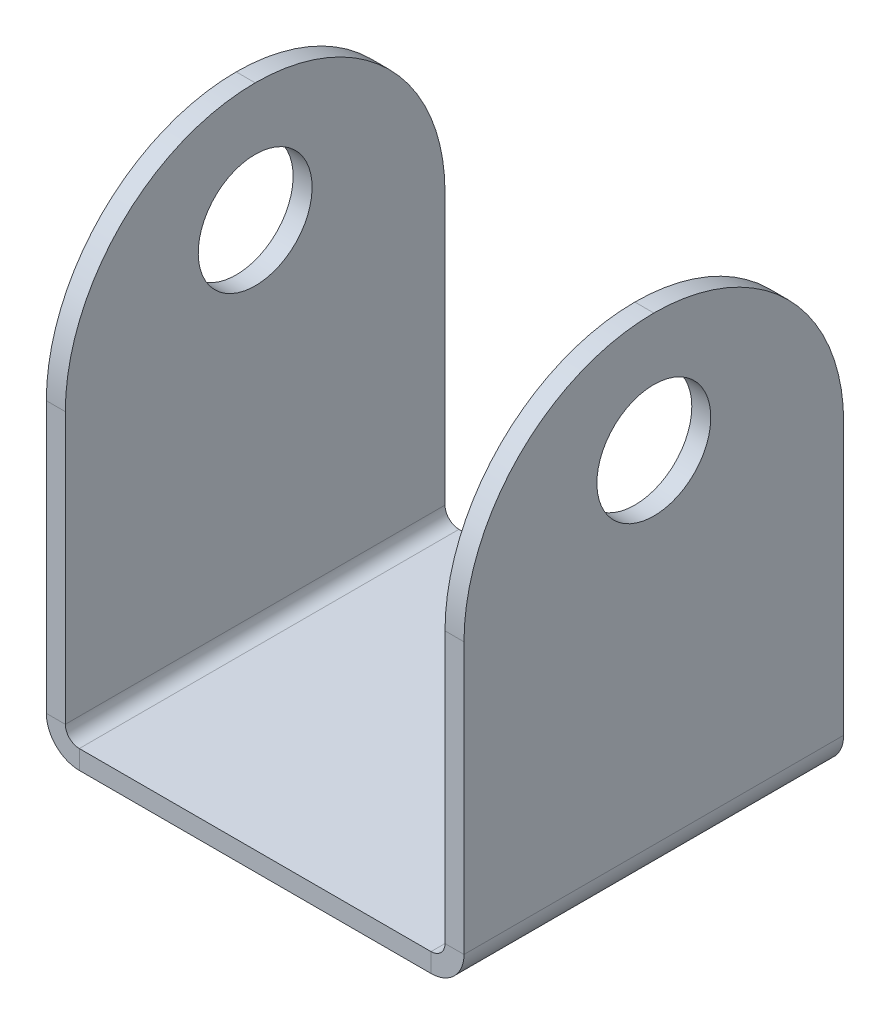
ISO-10303-21;
HEADER;
FILE_DESCRIPTION(('STEP AP214'),'2;1');
FILE_NAME('part.step','',(''),(''),'','','');
FILE_SCHEMA(('AUTOMOTIVE_DESIGN { 1 0 10303 214 1 1 1 1 }'));
ENDSEC;
DATA;
#1=APPLICATION_CONTEXT('core data for automotive mechanical design processes');
#2=APPLICATION_PROTOCOL_DEFINITION('international standard','automotive_design',2000,#1);
#3=PRODUCT_CONTEXT('',#1,'mechanical');
#4=PRODUCT('Part','Part','',(#3));
#5=PRODUCT_RELATED_PRODUCT_CATEGORY('part','',(#4));
#6=PRODUCT_DEFINITION_FORMATION('','',#4);
#7=PRODUCT_DEFINITION_CONTEXT('part definition',#1,'design');
#8=PRODUCT_DEFINITION('design','',#6,#7);
#9=PRODUCT_DEFINITION_SHAPE('','',#8);
#10=(LENGTH_UNIT() NAMED_UNIT(*) SI_UNIT(.MILLI.,.METRE.));
#11=(NAMED_UNIT(*) PLANE_ANGLE_UNIT() SI_UNIT($,.RADIAN.));
#12=(NAMED_UNIT(*) SI_UNIT($,.STERADIAN.) SOLID_ANGLE_UNIT());
#13=UNCERTAINTY_MEASURE_WITH_UNIT(LENGTH_MEASURE(1.E-05),#10,'distance_accuracy_value','');
#14=(GEOMETRIC_REPRESENTATION_CONTEXT(3) GLOBAL_UNCERTAINTY_ASSIGNED_CONTEXT((#13)) GLOBAL_UNIT_ASSIGNED_CONTEXT((#10,
#11,#12)) REPRESENTATION_CONTEXT('',''));
#15=CARTESIAN_POINT('',(0.,0.,0.));
#16=DIRECTION('',(0.,0.,1.));
#17=DIRECTION('',(1.,0.,0.));
#18=AXIS2_PLACEMENT_3D('',#15,#16,#17);
#19=CARTESIAN_POINT('',(0.,-1.,0.));
#20=DIRECTION('',(0.,-1.,0.));
#21=DIRECTION('',(0.,0.,-1.));
#22=AXIS2_PLACEMENT_3D('',#19,#20,#21);
#23=PLANE('',#22);
#24=DIRECTION('',(1.,0.,0.));
#25=VECTOR('',#24,1.);
#26=CARTESIAN_POINT('',(-10.,-1.,10.));
#27=LINE('',#26,#25);
#28=CARTESIAN_POINT('',(-9.2634,-1.,10.));
#29=VERTEX_POINT('',#28);
#30=CARTESIAN_POINT('',(9.2634,-1.,10.));
#31=VERTEX_POINT('',#30);
#32=EDGE_CURVE('E241',#29,#31,#27,.T.);
#33=ORIENTED_EDGE('',*,*,#32,.F.);
#34=DIRECTION('',(0.,0.,1.));
#35=VECTOR('',#34,1.);
#36=CARTESIAN_POINT('',(-9.2634,-1.,10.));
#37=LINE('',#36,#35);
#38=CARTESIAN_POINT('',(-9.2634,-1.,-10.));
#39=VERTEX_POINT('',#38);
#40=EDGE_CURVE('E147',#29,#39,#37,.F.);
#41=ORIENTED_EDGE('',*,*,#40,.T.);
#42=DIRECTION('',(-1.,0.,0.));
#43=VECTOR('',#42,1.);
#44=CARTESIAN_POINT('',(-10.,-1.,-10.));
#45=LINE('',#44,#43);
#46=CARTESIAN_POINT('',(9.2634,-1.,-10.));
#47=VERTEX_POINT('',#46);
#48=EDGE_CURVE('E238',#47,#39,#45,.T.);
#49=ORIENTED_EDGE('',*,*,#48,.F.);
#50=DIRECTION('',(0.,0.,-1.));
#51=VECTOR('',#50,1.);
#52=CARTESIAN_POINT('',(9.2634,-1.,-10.));
#53=LINE('',#52,#51);
#54=EDGE_CURVE('E215',#47,#31,#53,.F.);
#55=ORIENTED_EDGE('',*,*,#54,.T.);
#56=EDGE_LOOP('',(#33,#41,#49,#55));
#57=FACE_BOUND('',#56,.T.);
#58=ADVANCED_FACE('F40',(#57),#23,.T.);
#59=CARTESIAN_POINT('',(0.,0.,0.));
#60=DIRECTION('',(0.,-1.,0.));
#61=DIRECTION('',(0.,0.,-1.));
#62=AXIS2_PLACEMENT_3D('',#59,#60,#61);
#63=PLANE('',#62);
#64=DIRECTION('',(0.,0.,1.));
#65=VECTOR('',#64,1.);
#66=CARTESIAN_POINT('',(-9.2634,0.,10.));
#67=LINE('',#66,#65);
#68=CARTESIAN_POINT('',(-9.2634,0.,10.));
#69=VERTEX_POINT('',#68);
#70=CARTESIAN_POINT('',(-9.2634,0.,-10.));
#71=VERTEX_POINT('',#70);
#72=EDGE_CURVE('E176',#69,#71,#67,.F.);
#73=ORIENTED_EDGE('',*,*,#72,.F.);
#74=DIRECTION('',(1.,0.,0.));
#75=VECTOR('',#74,1.);
#76=CARTESIAN_POINT('',(-10.,0.,10.));
#77=LINE('',#76,#75);
#78=CARTESIAN_POINT('',(9.2634,0.,10.));
#79=VERTEX_POINT('',#78);
#80=EDGE_CURVE('E242',#69,#79,#77,.T.);
#81=ORIENTED_EDGE('',*,*,#80,.T.);
#82=DIRECTION('',(0.,0.,-1.));
#83=VECTOR('',#82,1.);
#84=CARTESIAN_POINT('',(9.2634,0.,-10.));
#85=LINE('',#84,#83);
#86=CARTESIAN_POINT('',(9.2634,0.,-10.));
#87=VERTEX_POINT('',#86);
#88=EDGE_CURVE('E228',#87,#79,#85,.F.);
#89=ORIENTED_EDGE('',*,*,#88,.F.);
#90=DIRECTION('',(-1.,0.,0.));
#91=VECTOR('',#90,1.);
#92=CARTESIAN_POINT('',(-10.,0.,-10.));
#93=LINE('',#92,#91);
#94=EDGE_CURVE('E235',#87,#71,#93,.T.);
#95=ORIENTED_EDGE('',*,*,#94,.T.);
#96=EDGE_LOOP('',(#73,#81,#89,#95));
#97=FACE_BOUND('',#96,.T.);
#98=ADVANCED_FACE('F329',(#97),#63,.F.);
#99=CARTESIAN_POINT('',(-10.,-1.,10.));
#100=DIRECTION('',(0.,0.,1.));
#101=DIRECTION('',(1.,0.,0.));
#102=AXIS2_PLACEMENT_3D('',#99,#100,#101);
#103=PLANE('',#102);
#104=ORIENTED_EDGE('',*,*,#80,.F.);
#105=DIRECTION('',(0.,-1.,0.));
#106=VECTOR('',#105,1.);
#107=CARTESIAN_POINT('',(-9.2634,0.,10.));
#108=LINE('',#107,#106);
#109=EDGE_CURVE('E185',#69,#29,#108,.T.);
#110=ORIENTED_EDGE('',*,*,#109,.T.);
#111=ORIENTED_EDGE('',*,*,#32,.T.);
#112=DIRECTION('',(0.,-1.,0.));
#113=VECTOR('',#112,1.);
#114=CARTESIAN_POINT('',(9.2634,0.,10.));
#115=LINE('',#114,#113);
#116=EDGE_CURVE('E232',#79,#31,#115,.T.);
#117=ORIENTED_EDGE('',*,*,#116,.F.);
#118=EDGE_LOOP('',(#104,#110,#111,#117));
#119=FACE_BOUND('',#118,.T.);
#120=ADVANCED_FACE('F320',(#119),#103,.T.);
#121=CARTESIAN_POINT('',(-10.,-1.,-10.));
#122=DIRECTION('',(0.,0.,-1.));
#123=DIRECTION('',(-1.,0.,0.));
#124=AXIS2_PLACEMENT_3D('',#121,#122,#123);
#125=PLANE('',#124);
#126=DIRECTION('',(0.,-1.,0.));
#127=VECTOR('',#126,1.);
#128=CARTESIAN_POINT('',(-9.2634,0.,-10.));
#129=LINE('',#128,#127);
#130=EDGE_CURVE('E190',#71,#39,#129,.T.);
#131=ORIENTED_EDGE('',*,*,#130,.F.);
#132=ORIENTED_EDGE('',*,*,#94,.F.);
#133=DIRECTION('',(0.,-1.,0.));
#134=VECTOR('',#133,1.);
#135=CARTESIAN_POINT('',(9.2634,0.,-10.));
#136=LINE('',#135,#134);
#137=EDGE_CURVE('E222',#87,#47,#136,.T.);
#138=ORIENTED_EDGE('',*,*,#137,.T.);
#139=ORIENTED_EDGE('',*,*,#48,.T.);
#140=EDGE_LOOP('',(#131,#132,#138,#139));
#141=FACE_BOUND('',#140,.T.);
#142=ADVANCED_FACE('F326',(#141),#125,.T.);
#143=CARTESIAN_POINT('',(9.2634,0.7366,10.));
#144=DIRECTION('',(0.,0.,1.));
#145=DIRECTION('',(1.,0.,0.));
#146=AXIS2_PLACEMENT_3D('',#143,#144,#145);
#147=PLANE('',#146);
#148=DIRECTION('',(1.,0.,0.));
#149=VECTOR('',#148,1.);
#150=CARTESIAN_POINT('',(10.,0.736599999999997,10.));
#151=LINE('',#150,#149);
#152=CARTESIAN_POINT('',(10.,0.736599999999997,10.));
#153=VERTEX_POINT('',#152);
#154=CARTESIAN_POINT('',(11.,0.736599999999993,10.));
#155=VERTEX_POINT('',#154);
#156=EDGE_CURVE('E193',#153,#155,#151,.T.);
#157=ORIENTED_EDGE('',*,*,#156,.F.);
#158=CARTESIAN_POINT('',(9.2634,0.7366,10.));
#159=DIRECTION('',(0.,0.,-1.));
#160=DIRECTION('',(-1.,0.,0.));
#161=AXIS2_PLACEMENT_3D('',#158,#159,#160);
#162=CIRCLE('',#161,0.7366);
#163=EDGE_CURVE('E225',#79,#153,#162,.F.);
#164=ORIENTED_EDGE('',*,*,#163,.F.);
#165=ORIENTED_EDGE('',*,*,#116,.T.);
#166=CARTESIAN_POINT('',(9.2634,0.7366,10.));
#167=DIRECTION('',(0.,0.,-1.));
#168=DIRECTION('',(-1.,0.,0.));
#169=AXIS2_PLACEMENT_3D('',#166,#167,#168);
#170=CIRCLE('',#169,1.7366);
#171=EDGE_CURVE('E218',#31,#155,#170,.F.);
#172=ORIENTED_EDGE('',*,*,#171,.T.);
#173=EDGE_LOOP('',(#157,#164,#165,#172));
#174=FACE_BOUND('',#173,.T.);
#175=ADVANCED_FACE('F315',(#174),#147,.T.);
#176=CARTESIAN_POINT('',(9.2634,0.7366,-10.));
#177=DIRECTION('',(0.,0.,1.));
#178=DIRECTION('',(1.,0.,0.));
#179=AXIS2_PLACEMENT_3D('',#176,#177,#178);
#180=PLANE('',#179);
#181=CARTESIAN_POINT('',(9.2634,0.7366,-10.));
#182=DIRECTION('',(0.,0.,-1.));
#183=DIRECTION('',(-1.,0.,0.));
#184=AXIS2_PLACEMENT_3D('',#181,#182,#183);
#185=CIRCLE('',#184,0.7366);
#186=CARTESIAN_POINT('',(10.,0.736599999999997,-10.));
#187=VERTEX_POINT('',#186);
#188=EDGE_CURVE('E211',#187,#87,#185,.T.);
#189=ORIENTED_EDGE('',*,*,#188,.F.);
#190=DIRECTION('',(1.,0.,0.));
#191=VECTOR('',#190,1.);
#192=CARTESIAN_POINT('',(10.,0.736599999999997,-10.));
#193=LINE('',#192,#191);
#194=CARTESIAN_POINT('',(11.,0.736599999999993,-10.));
#195=VERTEX_POINT('',#194);
#196=EDGE_CURVE('E197',#187,#195,#193,.T.);
#197=ORIENTED_EDGE('',*,*,#196,.T.);
#198=CARTESIAN_POINT('',(9.2634,0.7366,-10.));
#199=DIRECTION('',(0.,0.,-1.));
#200=DIRECTION('',(-1.,0.,0.));
#201=AXIS2_PLACEMENT_3D('',#198,#199,#200);
#202=CIRCLE('',#201,1.7366);
#203=EDGE_CURVE('E219',#195,#47,#202,.T.);
#204=ORIENTED_EDGE('',*,*,#203,.T.);
#205=ORIENTED_EDGE('',*,*,#137,.F.);
#206=EDGE_LOOP('',(#189,#197,#204,#205));
#207=FACE_BOUND('',#206,.T.);
#208=ADVANCED_FACE('F306',(#207),#180,.F.);
#209=CARTESIAN_POINT('',(9.2634,0.7366,-10.));
#210=DIRECTION('',(0.,0.,-1.));
#211=DIRECTION('',(1.,0.,0.));
#212=AXIS2_PLACEMENT_3D('',#209,#210,#211);
#213=CYLINDRICAL_SURFACE('',#212,1.7366);
#214=ORIENTED_EDGE('',*,*,#54,.F.);
#215=ORIENTED_EDGE('',*,*,#203,.F.);
#216=DIRECTION('',(0.,0.,1.));
#217=VECTOR('',#216,1.);
#218=CARTESIAN_POINT('',(11.,0.736599999999993,0.));
#219=LINE('',#218,#217);
#220=EDGE_CURVE('E200',#195,#155,#219,.T.);
#221=ORIENTED_EDGE('',*,*,#220,.T.);
#222=ORIENTED_EDGE('',*,*,#171,.F.);
#223=EDGE_LOOP('',(#214,#215,#221,#222));
#224=FACE_BOUND('',#223,.T.);
#225=ADVANCED_FACE('F313',(#224),#213,.T.);
#226=CARTESIAN_POINT('',(9.2634,0.7366,-10.));
#227=DIRECTION('',(0.,0.,-1.));
#228=DIRECTION('',(1.,0.,0.));
#229=AXIS2_PLACEMENT_3D('',#226,#227,#228);
#230=CYLINDRICAL_SURFACE('',#229,0.7366);
#231=ORIENTED_EDGE('',*,*,#88,.T.);
#232=ORIENTED_EDGE('',*,*,#163,.T.);
#233=DIRECTION('',(0.,0.,-1.));
#234=VECTOR('',#233,1.);
#235=CARTESIAN_POINT('',(10.,0.736599999999997,10.));
#236=LINE('',#235,#234);
#237=EDGE_CURVE('E195',#153,#187,#236,.T.);
#238=ORIENTED_EDGE('',*,*,#237,.T.);
#239=ORIENTED_EDGE('',*,*,#188,.T.);
#240=EDGE_LOOP('',(#231,#232,#238,#239));
#241=FACE_BOUND('',#240,.T.);
#242=ADVANCED_FACE('F301',(#241),#230,.F.);
#243=CARTESIAN_POINT('',(11.,0.,10.));
#244=DIRECTION('',(0.,0.,-1.));
#245=DIRECTION('',(-1.,0.,0.));
#246=AXIS2_PLACEMENT_3D('',#243,#244,#245);
#247=PLANE('',#246);
#248=DIRECTION('',(0.,-1.,0.));
#249=VECTOR('',#248,1.);
#250=CARTESIAN_POINT('',(11.,0.,10.));
#251=LINE('',#250,#249);
#252=CARTESIAN_POINT('',(11.0000000000001,15.,10.));
#253=VERTEX_POINT('',#252);
#254=EDGE_CURVE('E206',#253,#155,#251,.T.);
#255=ORIENTED_EDGE('',*,*,#254,.F.);
#256=DIRECTION('',(-1.,0.,0.));
#257=VECTOR('',#256,1.);
#258=CARTESIAN_POINT('',(11.0000000000001,15.,10.));
#259=LINE('',#258,#257);
#260=CARTESIAN_POINT('',(10.0000000000001,15.,10.));
#261=VERTEX_POINT('',#260);
#262=EDGE_CURVE('E49',#253,#261,#259,.T.);
#263=ORIENTED_EDGE('',*,*,#262,.T.);
#264=DIRECTION('',(0.,-1.,0.));
#265=VECTOR('',#264,1.);
#266=CARTESIAN_POINT('',(10.,0.,10.));
#267=LINE('',#266,#265);
#268=EDGE_CURVE('E205',#261,#153,#267,.T.);
#269=ORIENTED_EDGE('',*,*,#268,.T.);
#270=ORIENTED_EDGE('',*,*,#156,.T.);
#271=EDGE_LOOP('',(#255,#263,#269,#270));
#272=FACE_BOUND('',#271,.T.);
#273=ADVANCED_FACE('F293',(#272),#247,.F.);
#274=CARTESIAN_POINT('',(11.0000000000001,25.,-10.));
#275=DIRECTION('',(0.,0.,1.));
#276=DIRECTION('',(0.,-1.,0.));
#277=AXIS2_PLACEMENT_3D('',#274,#275,#276);
#278=PLANE('',#277);
#279=DIRECTION('',(0.,1.,0.));
#280=VECTOR('',#279,1.);
#281=CARTESIAN_POINT('',(10.0000000000001,25.,-10.));
#282=LINE('',#281,#280);
#283=CARTESIAN_POINT('',(10.0000000000001,15.,-10.));
#284=VERTEX_POINT('',#283);
#285=EDGE_CURVE('E209',#187,#284,#282,.T.);
#286=ORIENTED_EDGE('',*,*,#285,.T.);
#287=DIRECTION('',(-1.,0.,0.));
#288=VECTOR('',#287,1.);
#289=CARTESIAN_POINT('',(11.0000000000001,15.,-10.));
#290=LINE('',#289,#288);
#291=CARTESIAN_POINT('',(11.0000000000001,15.,-10.));
#292=VERTEX_POINT('',#291);
#293=EDGE_CURVE('E269',#284,#292,#290,.F.);
#294=ORIENTED_EDGE('',*,*,#293,.T.);
#295=DIRECTION('',(0.,1.,0.));
#296=VECTOR('',#295,1.);
#297=CARTESIAN_POINT('',(11.0000000000001,25.,-10.));
#298=LINE('',#297,#296);
#299=EDGE_CURVE('E208',#195,#292,#298,.T.);
#300=ORIENTED_EDGE('',*,*,#299,.F.);
#301=ORIENTED_EDGE('',*,*,#196,.F.);
#302=EDGE_LOOP('',(#286,#294,#300,#301));
#303=FACE_BOUND('',#302,.T.);
#304=ADVANCED_FACE('F310',(#303),#278,.F.);
#305=CARTESIAN_POINT('',(11.,0.,0.));
#306=DIRECTION('',(-1.,0.,0.));
#307=DIRECTION('',(0.,-1.,0.));
#308=AXIS2_PLACEMENT_3D('',#305,#306,#307);
#309=PLANE('',#308);
#310=CARTESIAN_POINT('',(11.0000000000001,18.7366,0.));
#311=DIRECTION('',(1.,0.,0.));
#312=DIRECTION('',(0.,1.,0.));
#313=AXIS2_PLACEMENT_3D('',#310,#311,#312);
#314=CIRCLE('',#313,3.);
#315=CARTESIAN_POINT('',(11.0000000000001,21.7366,0.));
#316=VERTEX_POINT('',#315);
#317=EDGE_CURVE('E276',#316,#316,#314,.T.);
#318=ORIENTED_EDGE('',*,*,#317,.F.);
#319=EDGE_LOOP('',(#318));
#320=FACE_BOUND('',#319,.T.);
#321=ORIENTED_EDGE('',*,*,#299,.T.);
#322=CARTESIAN_POINT('',(11.0000000000001,15.,0.));
#323=DIRECTION('',(-1.,0.,0.));
#324=DIRECTION('',(0.,-1.,0.));
#325=AXIS2_PLACEMENT_3D('',#322,#323,#324);
#326=CIRCLE('',#325,10.);
#327=CARTESIAN_POINT('',(11.0000000000001,25.,0.));
#328=VERTEX_POINT('',#327);
#329=EDGE_CURVE('E62',#292,#328,#326,.F.);
#330=ORIENTED_EDGE('',*,*,#329,.T.);
#331=CARTESIAN_POINT('',(11.0000000000001,15.,0.));
#332=DIRECTION('',(-1.,0.,0.));
#333=DIRECTION('',(0.,-1.,0.));
#334=AXIS2_PLACEMENT_3D('',#331,#332,#333);
#335=CIRCLE('',#334,10.);
#336=EDGE_CURVE('E57',#328,#253,#335,.F.);
#337=ORIENTED_EDGE('',*,*,#336,.T.);
#338=ORIENTED_EDGE('',*,*,#254,.T.);
#339=ORIENTED_EDGE('',*,*,#220,.F.);
#340=EDGE_LOOP('',(#321,#330,#337,#338,#339));
#341=FACE_BOUND('',#340,.T.);
#342=ADVANCED_FACE('F311',(#320,#341),#309,.F.);
#343=CARTESIAN_POINT('',(10.,0.,0.));
#344=DIRECTION('',(-1.,0.,0.));
#345=DIRECTION('',(0.,-1.,0.));
#346=AXIS2_PLACEMENT_3D('',#343,#344,#345);
#347=PLANE('',#346);
#348=CARTESIAN_POINT('',(10.0000000000001,18.7366,0.));
#349=DIRECTION('',(-1.,0.,0.));
#350=DIRECTION('',(0.,-1.,0.));
#351=AXIS2_PLACEMENT_3D('',#348,#349,#350);
#352=CIRCLE('',#351,3.);
#353=CARTESIAN_POINT('',(10.0000000000001,15.7366,0.));
#354=VERTEX_POINT('',#353);
#355=EDGE_CURVE('E253',#354,#354,#352,.T.);
#356=ORIENTED_EDGE('',*,*,#355,.F.);
#357=EDGE_LOOP('',(#356));
#358=FACE_BOUND('',#357,.T.);
#359=CARTESIAN_POINT('',(10.0000000000001,15.,0.));
#360=DIRECTION('',(-1.,0.,0.));
#361=DIRECTION('',(0.,-1.,0.));
#362=AXIS2_PLACEMENT_3D('',#359,#360,#361);
#363=CIRCLE('',#362,10.);
#364=CARTESIAN_POINT('',(10.0000000000001,25.,0.));
#365=VERTEX_POINT('',#364);
#366=EDGE_CURVE('E265',#261,#365,#363,.T.);
#367=ORIENTED_EDGE('',*,*,#366,.T.);
#368=CARTESIAN_POINT('',(10.0000000000001,15.,0.));
#369=DIRECTION('',(-1.,0.,0.));
#370=DIRECTION('',(0.,-1.,0.));
#371=AXIS2_PLACEMENT_3D('',#368,#369,#370);
#372=CIRCLE('',#371,10.);
#373=EDGE_CURVE('E267',#365,#284,#372,.T.);
#374=ORIENTED_EDGE('',*,*,#373,.T.);
#375=ORIENTED_EDGE('',*,*,#285,.F.);
#376=ORIENTED_EDGE('',*,*,#237,.F.);
#377=ORIENTED_EDGE('',*,*,#268,.F.);
#378=EDGE_LOOP('',(#367,#374,#375,#376,#377));
#379=FACE_BOUND('',#378,.T.);
#380=ADVANCED_FACE('F297',(#358,#379),#347,.T.);
#381=CARTESIAN_POINT('',(-9.2634,0.7366,-10.));
#382=DIRECTION('',(0.,0.,-1.));
#383=DIRECTION('',(-1.,0.,0.));
#384=AXIS2_PLACEMENT_3D('',#381,#382,#383);
#385=PLANE('',#384);
#386=DIRECTION('',(-1.,0.,0.));
#387=VECTOR('',#386,1.);
#388=CARTESIAN_POINT('',(-10.,0.736599999999997,-10.));
#389=LINE('',#388,#387);
#390=CARTESIAN_POINT('',(-10.,0.736599999999997,-10.));
#391=VERTEX_POINT('',#390);
#392=CARTESIAN_POINT('',(-11.,0.736599999999993,-10.));
#393=VERTEX_POINT('',#392);
#394=EDGE_CURVE('E338',#391,#393,#389,.T.);
#395=ORIENTED_EDGE('',*,*,#394,.F.);
#396=CARTESIAN_POINT('',(-9.2634,0.7366,-10.));
#397=DIRECTION('',(0.,0.,1.));
#398=DIRECTION('',(1.,0.,0.));
#399=AXIS2_PLACEMENT_3D('',#396,#397,#398);
#400=CIRCLE('',#399,0.7366);
#401=EDGE_CURVE('E150',#71,#391,#400,.F.);
#402=ORIENTED_EDGE('',*,*,#401,.F.);
#403=ORIENTED_EDGE('',*,*,#130,.T.);
#404=CARTESIAN_POINT('',(-9.2634,0.7366,-10.));
#405=DIRECTION('',(0.,0.,1.));
#406=DIRECTION('',(1.,0.,0.));
#407=AXIS2_PLACEMENT_3D('',#404,#405,#406);
#408=CIRCLE('',#407,1.7366);
#409=EDGE_CURVE('E184',#39,#393,#408,.F.);
#410=ORIENTED_EDGE('',*,*,#409,.T.);
#411=EDGE_LOOP('',(#395,#402,#403,#410));
#412=FACE_BOUND('',#411,.T.);
#413=ADVANCED_FACE('F336',(#412),#385,.T.);
#414=CARTESIAN_POINT('',(-9.2634,0.7366,10.));
#415=DIRECTION('',(0.,0.,-1.));
#416=DIRECTION('',(-1.,0.,0.));
#417=AXIS2_PLACEMENT_3D('',#414,#415,#416);
#418=PLANE('',#417);
#419=CARTESIAN_POINT('',(-9.2634,0.7366,10.));
#420=DIRECTION('',(0.,0.,1.));
#421=DIRECTION('',(1.,0.,0.));
#422=AXIS2_PLACEMENT_3D('',#419,#420,#421);
#423=CIRCLE('',#422,0.7366);
#424=CARTESIAN_POINT('',(-10.,0.736599999999997,10.));
#425=VERTEX_POINT('',#424);
#426=EDGE_CURVE('E157',#425,#69,#423,.T.);
#427=ORIENTED_EDGE('',*,*,#426,.F.);
#428=DIRECTION('',(-1.,0.,0.));
#429=VECTOR('',#428,1.);
#430=CARTESIAN_POINT('',(-10.,0.736599999999997,10.));
#431=LINE('',#430,#429);
#432=CARTESIAN_POINT('',(-11.,0.736599999999993,10.));
#433=VERTEX_POINT('',#432);
#434=EDGE_CURVE('E154',#425,#433,#431,.T.);
#435=ORIENTED_EDGE('',*,*,#434,.T.);
#436=CARTESIAN_POINT('',(-9.2634,0.7366,10.));
#437=DIRECTION('',(0.,0.,1.));
#438=DIRECTION('',(1.,0.,0.));
#439=AXIS2_PLACEMENT_3D('',#436,#437,#438);
#440=CIRCLE('',#439,1.7366);
#441=EDGE_CURVE('E140',#433,#29,#440,.T.);
#442=ORIENTED_EDGE('',*,*,#441,.T.);
#443=ORIENTED_EDGE('',*,*,#109,.F.);
#444=EDGE_LOOP('',(#427,#435,#442,#443));
#445=FACE_BOUND('',#444,.T.);
#446=ADVANCED_FACE('F155',(#445),#418,.F.);
#447=CARTESIAN_POINT('',(-9.2634,0.7366,10.));
#448=DIRECTION('',(0.,0.,1.));
#449=DIRECTION('',(-1.,0.,0.));
#450=AXIS2_PLACEMENT_3D('',#447,#448,#449);
#451=CYLINDRICAL_SURFACE('',#450,1.7366);
#452=ORIENTED_EDGE('',*,*,#40,.F.);
#453=ORIENTED_EDGE('',*,*,#441,.F.);
#454=DIRECTION('',(0.,0.,-1.));
#455=VECTOR('',#454,1.);
#456=CARTESIAN_POINT('',(-11.,0.736599999999993,0.));
#457=LINE('',#456,#455);
#458=EDGE_CURVE('E144',#433,#393,#457,.T.);
#459=ORIENTED_EDGE('',*,*,#458,.T.);
#460=ORIENTED_EDGE('',*,*,#409,.F.);
#461=EDGE_LOOP('',(#452,#453,#459,#460));
#462=FACE_BOUND('',#461,.T.);
#463=ADVANCED_FACE('F142',(#462),#451,.T.);
#464=CARTESIAN_POINT('',(-9.2634,0.7366,10.));
#465=DIRECTION('',(0.,0.,1.));
#466=DIRECTION('',(-1.,0.,0.));
#467=AXIS2_PLACEMENT_3D('',#464,#465,#466);
#468=CYLINDRICAL_SURFACE('',#467,0.7366);
#469=ORIENTED_EDGE('',*,*,#72,.T.);
#470=ORIENTED_EDGE('',*,*,#401,.T.);
#471=DIRECTION('',(0.,0.,1.));
#472=VECTOR('',#471,1.);
#473=CARTESIAN_POINT('',(-10.,0.736599999999997,-10.));
#474=LINE('',#473,#472);
#475=EDGE_CURVE('E162',#391,#425,#474,.T.);
#476=ORIENTED_EDGE('',*,*,#475,.T.);
#477=ORIENTED_EDGE('',*,*,#426,.T.);
#478=EDGE_LOOP('',(#469,#470,#476,#477));
#479=FACE_BOUND('',#478,.T.);
#480=ADVANCED_FACE('F332',(#479),#468,.F.);
#481=CARTESIAN_POINT('',(-11.,0.,-10.));
#482=DIRECTION('',(0.,0.,1.));
#483=DIRECTION('',(1.,0.,0.));
#484=AXIS2_PLACEMENT_3D('',#481,#482,#483);
#485=PLANE('',#484);
#486=DIRECTION('',(0.,-1.,0.));
#487=VECTOR('',#486,1.);
#488=CARTESIAN_POINT('',(-11.,0.,-10.));
#489=LINE('',#488,#487);
#490=CARTESIAN_POINT('',(-11.0000000000001,15.,-10.));
#491=VERTEX_POINT('',#490);
#492=EDGE_CURVE('E170',#491,#393,#489,.T.);
#493=ORIENTED_EDGE('',*,*,#492,.F.);
#494=DIRECTION('',(1.,0.,0.));
#495=VECTOR('',#494,1.);
#496=CARTESIAN_POINT('',(-11.0000000000001,15.,-10.));
#497=LINE('',#496,#495);
#498=CARTESIAN_POINT('',(-10.,15.,-10.));
#499=VERTEX_POINT('',#498);
#500=EDGE_CURVE('E245',#491,#499,#497,.T.);
#501=ORIENTED_EDGE('',*,*,#500,.T.);
#502=DIRECTION('',(0.,-1.,0.));
#503=VECTOR('',#502,1.);
#504=CARTESIAN_POINT('',(-10.,0.,-10.));
#505=LINE('',#504,#503);
#506=EDGE_CURVE('E171',#499,#391,#505,.T.);
#507=ORIENTED_EDGE('',*,*,#506,.T.);
#508=ORIENTED_EDGE('',*,*,#394,.T.);
#509=EDGE_LOOP('',(#493,#501,#507,#508));
#510=FACE_BOUND('',#509,.T.);
#511=ADVANCED_FACE('F452',(#510),#485,.F.);
#512=CARTESIAN_POINT('',(-11.0000000000001,25.,9.99999999999999));
#513=DIRECTION('',(0.,0.,-1.));
#514=DIRECTION('',(0.,1.,0.));
#515=AXIS2_PLACEMENT_3D('',#512,#513,#514);
#516=PLANE('',#515);
#517=DIRECTION('',(0.,1.,0.));
#518=VECTOR('',#517,1.);
#519=CARTESIAN_POINT('',(-10.0000000000001,25.,9.99999999999999));
#520=LINE('',#519,#518);
#521=CARTESIAN_POINT('',(-10.,15.,10.));
#522=VERTEX_POINT('',#521);
#523=EDGE_CURVE('E178',#425,#522,#520,.T.);
#524=ORIENTED_EDGE('',*,*,#523,.T.);
#525=DIRECTION('',(1.,0.,0.));
#526=VECTOR('',#525,1.);
#527=CARTESIAN_POINT('',(-11.0000000000001,15.,10.));
#528=LINE('',#527,#526);
#529=CARTESIAN_POINT('',(-11.0000000000001,15.,10.));
#530=VERTEX_POINT('',#529);
#531=EDGE_CURVE('E11',#522,#530,#528,.F.);
#532=ORIENTED_EDGE('',*,*,#531,.T.);
#533=DIRECTION('',(0.,1.,0.));
#534=VECTOR('',#533,1.);
#535=CARTESIAN_POINT('',(-11.0000000000001,25.,9.99999999999999));
#536=LINE('',#535,#534);
#537=EDGE_CURVE('E167',#433,#530,#536,.T.);
#538=ORIENTED_EDGE('',*,*,#537,.F.);
#539=ORIENTED_EDGE('',*,*,#434,.F.);
#540=EDGE_LOOP('',(#524,#532,#538,#539));
#541=FACE_BOUND('',#540,.T.);
#542=ADVANCED_FACE('F173',(#541),#516,.F.);
#543=CARTESIAN_POINT('',(-11.,0.,0.));
#544=DIRECTION('',(1.,0.,0.));
#545=DIRECTION('',(0.,1.,0.));
#546=AXIS2_PLACEMENT_3D('',#543,#544,#545);
#547=PLANE('',#546);
#548=CARTESIAN_POINT('',(-11.0000000000001,18.7366000000001,0.));
#549=DIRECTION('',(1.,0.,0.));
#550=DIRECTION('',(0.,1.,0.));
#551=AXIS2_PLACEMENT_3D('',#548,#549,#550);
#552=CIRCLE('',#551,3.);
#553=CARTESIAN_POINT('',(-11.0000000000001,21.7366000000001,0.));
#554=VERTEX_POINT('',#553);
#555=EDGE_CURVE('E254',#554,#554,#552,.T.);
#556=ORIENTED_EDGE('',*,*,#555,.T.);
#557=EDGE_LOOP('',(#556));
#558=FACE_BOUND('',#557,.T.);
#559=CARTESIAN_POINT('',(-11.0000000000001,15.,0.));
#560=DIRECTION('',(1.,0.,0.));
#561=DIRECTION('',(0.,1.,0.));
#562=AXIS2_PLACEMENT_3D('',#559,#560,#561);
#563=CIRCLE('',#562,10.);
#564=CARTESIAN_POINT('',(-11.0000000000001,25.,0.));
#565=VERTEX_POINT('',#564);
#566=EDGE_CURVE('E261',#530,#565,#563,.F.);
#567=ORIENTED_EDGE('',*,*,#566,.T.);
#568=CARTESIAN_POINT('',(-11.0000000000001,15.,0.));
#569=DIRECTION('',(1.,0.,0.));
#570=DIRECTION('',(0.,1.,0.));
#571=AXIS2_PLACEMENT_3D('',#568,#569,#570);
#572=CIRCLE('',#571,10.);
#573=EDGE_CURVE('E263',#565,#491,#572,.F.);
#574=ORIENTED_EDGE('',*,*,#573,.T.);
#575=ORIENTED_EDGE('',*,*,#492,.T.);
#576=ORIENTED_EDGE('',*,*,#458,.F.);
#577=ORIENTED_EDGE('',*,*,#537,.T.);
#578=EDGE_LOOP('',(#567,#574,#575,#576,#577));
#579=FACE_BOUND('',#578,.T.);
#580=ADVANCED_FACE('F166',(#558,#579),#547,.F.);
#581=CARTESIAN_POINT('',(-10.,0.,0.));
#582=DIRECTION('',(1.,0.,0.));
#583=DIRECTION('',(0.,1.,0.));
#584=AXIS2_PLACEMENT_3D('',#581,#582,#583);
#585=PLANE('',#584);
#586=CARTESIAN_POINT('',(-10.0000000000001,18.7366000000001,0.));
#587=DIRECTION('',(1.,0.,0.));
#588=DIRECTION('',(0.,1.,0.));
#589=AXIS2_PLACEMENT_3D('',#586,#587,#588);
#590=CIRCLE('',#589,3.);
#591=CARTESIAN_POINT('',(-10.0000000000001,21.7366000000001,0.));
#592=VERTEX_POINT('',#591);
#593=EDGE_CURVE('E250',#592,#592,#590,.T.);
#594=ORIENTED_EDGE('',*,*,#593,.F.);
#595=EDGE_LOOP('',(#594));
#596=FACE_BOUND('',#595,.T.);
#597=ORIENTED_EDGE('',*,*,#506,.F.);
#598=CARTESIAN_POINT('',(-10.,15.,0.));
#599=DIRECTION('',(1.,0.,0.));
#600=DIRECTION('',(0.,1.,0.));
#601=AXIS2_PLACEMENT_3D('',#598,#599,#600);
#602=CIRCLE('',#601,10.);
#603=CARTESIAN_POINT('',(-10.0000000000001,25.,0.));
#604=VERTEX_POINT('',#603);
#605=EDGE_CURVE('E259',#499,#604,#602,.T.);
#606=ORIENTED_EDGE('',*,*,#605,.T.);
#607=CARTESIAN_POINT('',(-10.,15.,0.));
#608=DIRECTION('',(1.,0.,0.));
#609=DIRECTION('',(0.,1.,0.));
#610=AXIS2_PLACEMENT_3D('',#607,#608,#609);
#611=CIRCLE('',#610,10.);
#612=EDGE_CURVE('E257',#604,#522,#611,.T.);
#613=ORIENTED_EDGE('',*,*,#612,.T.);
#614=ORIENTED_EDGE('',*,*,#523,.F.);
#615=ORIENTED_EDGE('',*,*,#475,.F.);
#616=EDGE_LOOP('',(#597,#606,#613,#614,#615));
#617=FACE_BOUND('',#616,.T.);
#618=ADVANCED_FACE('F352',(#596,#617),#585,.T.);
#619=CARTESIAN_POINT('',(-11.0000000000001,18.7366000000001,0.));
#620=DIRECTION('',(1.,0.,0.));
#621=DIRECTION('',(0.,1.,0.));
#622=AXIS2_PLACEMENT_3D('',#619,#620,#621);
#623=CYLINDRICAL_SURFACE('',#622,3.);
#624=ORIENTED_EDGE('',*,*,#593,.T.);
#625=EDGE_LOOP('',(#624));
#626=FACE_BOUND('',#625,.T.);
#627=ORIENTED_EDGE('',*,*,#555,.F.);
#628=EDGE_LOOP('',(#627));
#629=FACE_BOUND('',#628,.T.);
#630=ADVANCED_FACE('F349',(#626,#629),#623,.F.);
#631=ORIENTED_EDGE('',*,*,#355,.T.);
#632=EDGE_LOOP('',(#631));
#633=FACE_BOUND('',#632,.T.);
#634=ORIENTED_EDGE('',*,*,#317,.T.);
#635=EDGE_LOOP('',(#634));
#636=FACE_BOUND('',#635,.T.);
#637=ADVANCED_FACE('F351',(#633,#636),#623,.F.);
#638=CARTESIAN_POINT('',(-11.0000000000001,15.,0.));
#639=DIRECTION('',(1.,0.,0.));
#640=DIRECTION('',(0.,1.,0.));
#641=AXIS2_PLACEMENT_3D('',#638,#639,#640);
#642=CYLINDRICAL_SURFACE('',#641,10.);
#643=DIRECTION('',(1.,0.,0.));
#644=VECTOR('',#643,1.);
#645=CARTESIAN_POINT('',(-11.0000000000001,25.,0.));
#646=LINE('',#645,#644);
#647=EDGE_CURVE('E274',#565,#604,#646,.T.);
#648=ORIENTED_EDGE('',*,*,#647,.F.);
#649=ORIENTED_EDGE('',*,*,#566,.F.);
#650=ORIENTED_EDGE('',*,*,#531,.F.);
#651=ORIENTED_EDGE('',*,*,#612,.F.);
#652=EDGE_LOOP('',(#648,#649,#650,#651));
#653=FACE_BOUND('',#652,.T.);
#654=ADVANCED_FACE('F359',(#653),#642,.T.);
#655=CARTESIAN_POINT('',(-11.0000000000001,15.,0.));
#656=DIRECTION('',(1.,0.,0.));
#657=DIRECTION('',(0.,1.,0.));
#658=AXIS2_PLACEMENT_3D('',#655,#656,#657);
#659=CYLINDRICAL_SURFACE('',#658,10.);
#660=ORIENTED_EDGE('',*,*,#573,.F.);
#661=ORIENTED_EDGE('',*,*,#647,.T.);
#662=ORIENTED_EDGE('',*,*,#605,.F.);
#663=ORIENTED_EDGE('',*,*,#500,.F.);
#664=EDGE_LOOP('',(#660,#661,#662,#663));
#665=FACE_BOUND('',#664,.T.);
#666=ADVANCED_FACE('F377',(#665),#659,.T.);
#667=CARTESIAN_POINT('',(11.0000000000001,15.,0.));
#668=DIRECTION('',(-1.,0.,0.));
#669=DIRECTION('',(0.,-1.,0.));
#670=AXIS2_PLACEMENT_3D('',#667,#668,#669);
#671=CYLINDRICAL_SURFACE('',#670,10.);
#672=ORIENTED_EDGE('',*,*,#262,.F.);
#673=ORIENTED_EDGE('',*,*,#336,.F.);
#674=DIRECTION('',(-1.,0.,0.));
#675=VECTOR('',#674,1.);
#676=CARTESIAN_POINT('',(11.0000000000001,25.,0.));
#677=LINE('',#676,#675);
#678=EDGE_CURVE('E44',#365,#328,#677,.F.);
#679=ORIENTED_EDGE('',*,*,#678,.F.);
#680=ORIENTED_EDGE('',*,*,#366,.F.);
#681=EDGE_LOOP('',(#672,#673,#679,#680));
#682=FACE_BOUND('',#681,.T.);
#683=ADVANCED_FACE('F42',(#682),#671,.T.);
#684=CARTESIAN_POINT('',(11.0000000000001,15.,0.));
#685=DIRECTION('',(-1.,0.,0.));
#686=DIRECTION('',(0.,-1.,0.));
#687=AXIS2_PLACEMENT_3D('',#684,#685,#686);
#688=CYLINDRICAL_SURFACE('',#687,10.);
#689=ORIENTED_EDGE('',*,*,#329,.F.);
#690=ORIENTED_EDGE('',*,*,#293,.F.);
#691=ORIENTED_EDGE('',*,*,#373,.F.);
#692=ORIENTED_EDGE('',*,*,#678,.T.);
#693=EDGE_LOOP('',(#689,#690,#691,#692));
#694=FACE_BOUND('',#693,.T.);
#695=ADVANCED_FACE('F286',(#694),#688,.T.);
#696=CLOSED_SHELL('',(#58,#98,#120,#142,#175,#208,#225,#242,#273,#304,#342,#380,#413,#446,#463,
#480,#511,#542,#580,#618,#630,#637,#654,#666,#683,#695));
#697=MANIFOLD_SOLID_BREP('B2',#696);
#698=ADVANCED_BREP_SHAPE_REPRESENTATION('',(#18,#697),#14);
#699=SHAPE_DEFINITION_REPRESENTATION(#9,#698);
ENDSEC;
END-ISO-10303-21;
